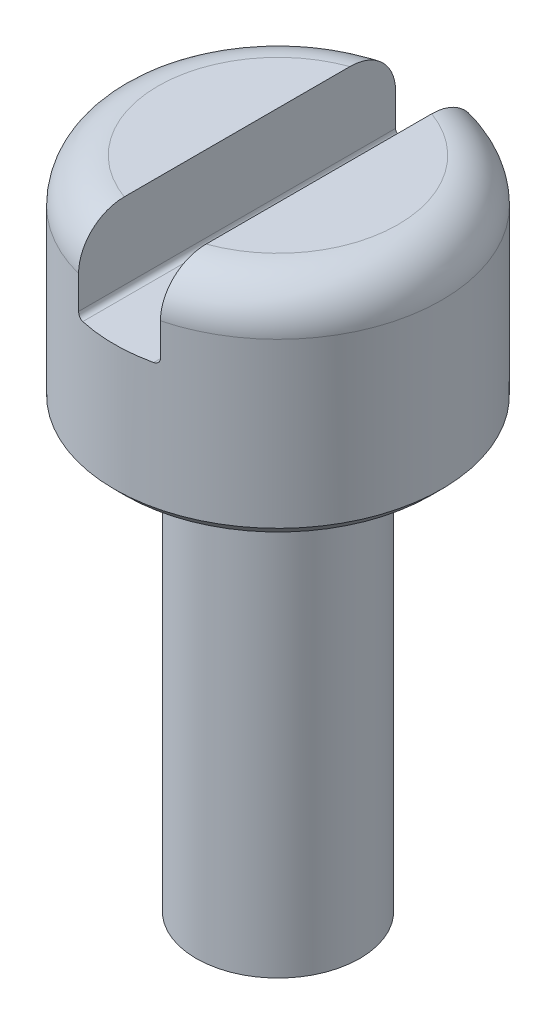
ISO-10303-21;
HEADER;
FILE_DESCRIPTION(('STEP AP214'),'2;1');
FILE_NAME('part.step','',(''),(''),'','','');
FILE_SCHEMA(('AUTOMOTIVE_DESIGN { 1 0 10303 214 1 1 1 1 }'));
ENDSEC;
DATA;
#1=APPLICATION_CONTEXT('core data for automotive mechanical design processes');
#2=APPLICATION_PROTOCOL_DEFINITION('international standard','automotive_design',2000,#1);
#3=PRODUCT_CONTEXT('',#1,'mechanical');
#4=PRODUCT('Part','Part','',(#3));
#5=PRODUCT_RELATED_PRODUCT_CATEGORY('part','',(#4));
#6=PRODUCT_DEFINITION_FORMATION('','',#4);
#7=PRODUCT_DEFINITION_CONTEXT('part definition',#1,'design');
#8=PRODUCT_DEFINITION('design','',#6,#7);
#9=PRODUCT_DEFINITION_SHAPE('','',#8);
#10=(LENGTH_UNIT() NAMED_UNIT(*) SI_UNIT(.MILLI.,.METRE.));
#11=(NAMED_UNIT(*) PLANE_ANGLE_UNIT() SI_UNIT($,.RADIAN.));
#12=(NAMED_UNIT(*) SI_UNIT($,.STERADIAN.) SOLID_ANGLE_UNIT());
#13=UNCERTAINTY_MEASURE_WITH_UNIT(LENGTH_MEASURE(1.E-05),#10,'distance_accuracy_value','');
#14=(GEOMETRIC_REPRESENTATION_CONTEXT(3) GLOBAL_UNCERTAINTY_ASSIGNED_CONTEXT((#13)) GLOBAL_UNIT_ASSIGNED_CONTEXT((#10,
#11,#12)) REPRESENTATION_CONTEXT('',''));
#15=CARTESIAN_POINT('',(0.,0.,0.));
#16=DIRECTION('',(0.,0.,1.));
#17=DIRECTION('',(1.,0.,0.));
#18=AXIS2_PLACEMENT_3D('',#15,#16,#17);
#19=CARTESIAN_POINT('',(0.,0.,0.));
#20=DIRECTION('',(0.,1.,0.));
#21=DIRECTION('',(0.,0.,1.));
#22=AXIS2_PLACEMENT_3D('',#19,#20,#21);
#23=PLANE('',#22);
#24=CARTESIAN_POINT('',(0.,0.,0.));
#25=DIRECTION('',(0.,1.,0.));
#26=DIRECTION('',(0.,0.,1.));
#27=AXIS2_PLACEMENT_3D('',#24,#25,#26);
#28=CIRCLE('',#27,1.4);
#29=CARTESIAN_POINT('',(0.,0.,1.4));
#30=VERTEX_POINT('',#29);
#31=EDGE_CURVE('E173',#30,#30,#28,.F.);
#32=ORIENTED_EDGE('',*,*,#31,.T.);
#33=EDGE_LOOP('',(#32));
#34=FACE_BOUND('',#33,.T.);
#35=CARTESIAN_POINT('',(0.,0.,0.));
#36=DIRECTION('',(0.,1.,0.));
#37=DIRECTION('',(0.,0.,1.));
#38=AXIS2_PLACEMENT_3D('',#35,#36,#37);
#39=CIRCLE('',#38,0.75);
#40=CARTESIAN_POINT('',(0.,0.,0.75));
#41=VERTEX_POINT('',#40);
#42=EDGE_CURVE('E125',#41,#41,#39,.F.);
#43=ORIENTED_EDGE('',*,*,#42,.F.);
#44=EDGE_LOOP('',(#43));
#45=FACE_BOUND('',#44,.T.);
#46=ADVANCED_FACE('F33',(#34,#45),#23,.F.);
#47=CARTESIAN_POINT('',(0.,2.,0.));
#48=DIRECTION('',(0.,1.,0.));
#49=DIRECTION('',(0.,0.,1.));
#50=AXIS2_PLACEMENT_3D('',#47,#48,#49);
#51=PLANE('',#50);
#52=DIRECTION('',(0.,0.,-1.));
#53=VECTOR('',#52,1.);
#54=CARTESIAN_POINT('',(0.375000000000001,2.,0.));
#55=LINE('',#54,#53);
#56=CARTESIAN_POINT('',(0.375000000000001,2.,1.03410589399732));
#57=VERTEX_POINT('',#56);
#58=CARTESIAN_POINT('',(0.375000000000001,2.,-1.03410589399732));
#59=VERTEX_POINT('',#58);
#60=EDGE_CURVE('E217',#57,#59,#55,.T.);
#61=ORIENTED_EDGE('',*,*,#60,.F.);
#62=CARTESIAN_POINT('',(0.,2.,0.));
#63=DIRECTION('',(0.,1.,0.));
#64=DIRECTION('',(0.,0.,1.));
#65=AXIS2_PLACEMENT_3D('',#62,#63,#64);
#66=CIRCLE('',#65,1.1);
#67=EDGE_CURVE('E176',#57,#59,#66,.T.);
#68=ORIENTED_EDGE('',*,*,#67,.T.);
#69=EDGE_LOOP('',(#61,#68));
#70=FACE_BOUND('',#69,.T.);
#71=ADVANCED_FACE('F204',(#70),#51,.T.);
#72=CARTESIAN_POINT('',(0.,2.,0.));
#73=DIRECTION('',(0.,-1.,0.));
#74=DIRECTION('',(0.,0.,-1.));
#75=AXIS2_PLACEMENT_3D('',#72,#73,#74);
#76=CYLINDRICAL_SURFACE('',#75,1.5);
#77=CARTESIAN_POINT('',(0.,0.0999999999999994,0.));
#78=DIRECTION('',(0.,1.,0.));
#79=DIRECTION('',(0.,0.,1.));
#80=AXIS2_PLACEMENT_3D('',#77,#78,#79);
#81=CIRCLE('',#80,1.5);
#82=CARTESIAN_POINT('',(0.,0.0999999999999994,1.5));
#83=VERTEX_POINT('',#82);
#84=EDGE_CURVE('E170',#83,#83,#81,.T.);
#85=ORIENTED_EDGE('',*,*,#84,.T.);
#86=EDGE_LOOP('',(#85));
#87=FACE_BOUND('',#86,.T.);
#88=DIRECTION('',(0.,-1.,0.));
#89=VECTOR('',#88,1.);
#90=CARTESIAN_POINT('',(0.375000000000001,2.,-1.45236875482778));
#91=LINE('',#90,#89);
#92=CARTESIAN_POINT('',(0.375000000000001,1.3,-1.45236875482778));
#93=VERTEX_POINT('',#92);
#94=CARTESIAN_POINT('',(0.375000000000001,1.6,-1.45236875482778));
#95=VERTEX_POINT('',#94);
#96=EDGE_CURVE('E224',#93,#95,#91,.F.);
#97=ORIENTED_EDGE('',*,*,#96,.T.);
#98=CARTESIAN_POINT('',(0.,1.6,0.));
#99=DIRECTION('',(0.,1.,0.));
#100=DIRECTION('',(0.,0.,1.));
#101=AXIS2_PLACEMENT_3D('',#98,#99,#100);
#102=CIRCLE('',#101,1.5);
#103=CARTESIAN_POINT('',(0.375000000000001,1.6,1.45236875482778));
#104=VERTEX_POINT('',#103);
#105=EDGE_CURVE('E283',#95,#104,#102,.F.);
#106=ORIENTED_EDGE('',*,*,#105,.T.);
#107=DIRECTION('',(0.,-1.,0.));
#108=VECTOR('',#107,1.);
#109=CARTESIAN_POINT('',(0.375000000000001,2.,1.45236875482778));
#110=LINE('',#109,#108);
#111=CARTESIAN_POINT('',(0.375000000000001,1.3,1.45236875482778));
#112=VERTEX_POINT('',#111);
#113=EDGE_CURVE('E222',#104,#112,#110,.T.);
#114=ORIENTED_EDGE('',*,*,#113,.T.);
#115=CARTESIAN_POINT('',(0.375000000000001,1.3,1.45236875482778));
#116=CARTESIAN_POINT('',(0.375002658495843,1.29724898962302,1.45236784547241));
#117=CARTESIAN_POINT('',(0.374773132764428,1.29449928598193,1.45242732919203));
#118=CARTESIAN_POINT('',(0.373870036300043,1.28908348301418,1.45266017482927));
#119=CARTESIAN_POINT('',(0.373197240015892,1.28641724635535,1.45283333813264));
#120=CARTESIAN_POINT('',(0.37142768061666,1.28123890723074,1.45328670886449));
#121=CARTESIAN_POINT('',(0.370330861346044,1.27872682523153,1.4535669304712));
#122=CARTESIAN_POINT('',(0.367749175369409,1.27392439303367,1.45422223994348));
#123=CARTESIAN_POINT('',(0.366264268601107,1.27163406576024,1.45459733760298));
#124=CARTESIAN_POINT('',(0.362926608333273,1.26730197875213,1.45543370437349));
#125=CARTESIAN_POINT('',(0.361068751668264,1.26526438415234,1.45589616301892));
#126=CARTESIAN_POINT('',(0.357053454126961,1.2615279312873,1.45688609755999));
#127=CARTESIAN_POINT('',(0.354895935139976,1.25982916162313,1.45741359040355));
#128=CARTESIAN_POINT('',(0.350273958150988,1.25676646552711,1.45853144095106));
#129=CARTESIAN_POINT('',(0.347802332912177,1.25541387141034,1.45912319237098));
#130=CARTESIAN_POINT('',(0.342673803954017,1.25314389356196,1.46033612476992));
#131=CARTESIAN_POINT('',(0.340016951014765,1.25222639108414,1.46095729766821));
#132=CARTESIAN_POINT('',(0.335294349979139,1.25102723759926,1.46204717854776));
#133=CARTESIAN_POINT('',(0.333253629914518,1.25064246855568,1.46251372764157));
#134=CARTESIAN_POINT('',(0.329142521258858,1.2501288288351,1.46344446391912));
#135=CARTESIAN_POINT('',(0.327072174187489,1.24999962977475,1.4639086533684));
#136=CARTESIAN_POINT('',(0.325000000000262,1.24999999999895,1.46436846456072));
#137=B_SPLINE_CURVE_WITH_KNOTS('',3,(#115,#116,#117,#118,#119,#120,#121,#122,#123,#124,#125,
#126,#127,#128,#129,#130,#131,#132,#133,#134,#135,#136),.UNSPECIFIED.,.F.,.F.,(4,2,2,2,2,2,2,2,
2,2,4),(0.,0.00824084837905611,0.0164673370150729,0.0246949155005202,0.0329233436548431,
0.0412731534711645,0.0496251438676928,0.0582230587972141,0.066818625811217,0.0731890380337759,
0.0795512595458543),.UNSPECIFIED.);
#138=CARTESIAN_POINT('',(0.325000000000001,1.25,1.46436846456075));
#139=VERTEX_POINT('',#138);
#140=EDGE_CURVE('E114',#112,#139,#137,.T.);
#141=ORIENTED_EDGE('',*,*,#140,.T.);
#142=CARTESIAN_POINT('',(0.,1.25,0.));
#143=DIRECTION('',(0.,-1.,0.));
#144=DIRECTION('',(0.,0.,-1.));
#145=AXIS2_PLACEMENT_3D('',#142,#143,#144);
#146=CIRCLE('',#145,1.5);
#147=CARTESIAN_POINT('',(-0.325,1.25,1.46436846456075));
#148=VERTEX_POINT('',#147);
#149=EDGE_CURVE('E126',#139,#148,#146,.T.);
#150=ORIENTED_EDGE('',*,*,#149,.T.);
#151=CARTESIAN_POINT('',(-0.325,1.25,1.46436846456075));
#152=CARTESIAN_POINT('',(-0.327876686191335,1.24999793567271,1.46373035847683));
#153=CARTESIAN_POINT('',(-0.330750733667663,1.25024813269043,1.46308327005522));
#154=CARTESIAN_POINT('',(-0.336413759925056,1.25123597933252,1.46179134924501));
#155=CARTESIAN_POINT('',(-0.33920275640253,1.25197352682073,1.46114651641215));
#156=CARTESIAN_POINT('',(-0.344618668530109,1.25391955932842,1.45987869041038));
#157=CARTESIAN_POINT('',(-0.347245493067138,1.2551283063424,1.45925570960196));
#158=CARTESIAN_POINT('',(-0.352258815800682,1.25798485111387,1.45805361954324));
#159=CARTESIAN_POINT('',(-0.354645384080543,1.25963252032232,1.4574744975115));
#160=CARTESIAN_POINT('',(-0.359088558777296,1.26330915714928,1.45638614756311));
#161=CARTESIAN_POINT('',(-0.361147712138581,1.26533488490247,1.4558763850956));
#162=CARTESIAN_POINT('',(-0.364894900320714,1.26972267066053,1.45494173441934));
#163=CARTESIAN_POINT('',(-0.366582895052759,1.27208476495096,1.4545168553793));
#164=CARTESIAN_POINT('',(-0.369492580489514,1.27701319429203,1.45378039478909));
#165=CARTESIAN_POINT('',(-0.370725114864685,1.27957274202579,1.45346618825205));
#166=CARTESIAN_POINT('',(-0.372740702329019,1.28487249665361,1.45295060547192));
#167=CARTESIAN_POINT('',(-0.37352422295132,1.28761251230872,1.45274911187234));
#168=CARTESIAN_POINT('',(-0.374378972449828,1.29198006815951,1.45252899501748));
#169=CARTESIAN_POINT('',(-0.374611720287969,1.29357565700116,1.45246896719965));
#170=CARTESIAN_POINT('',(-0.374922180924248,1.29678056195335,1.45238884879229));
#171=CARTESIAN_POINT('',(-0.375000111689678,1.29838985555626,1.45236870205424));
#172=CARTESIAN_POINT('',(-0.375000000000033,1.29999999999999,1.4523687548278));
#173=B_SPLINE_CURVE_WITH_KNOTS('',3,(#151,#152,#153,#154,#155,#156,#157,#158,#159,#160,#161,
#162,#163,#164,#165,#166,#167,#168,#169,#170,#171,#172),.UNSPECIFIED.,.F.,.F.,(4,2,2,2,2,2,2,2,
2,2,4),(0.,0.00882838583704185,0.0176549220575412,0.026486372990102,0.0353152402560846,
0.0440716582890352,0.0528290216376884,0.0613619075509072,0.0698858924236887,0.0747194623886041,
0.0795462223234138),.UNSPECIFIED.);
#174=CARTESIAN_POINT('',(-0.375,1.3,1.45236875482778));
#175=VERTEX_POINT('',#174);
#176=EDGE_CURVE('E115',#148,#175,#173,.T.);
#177=ORIENTED_EDGE('',*,*,#176,.T.);
#178=DIRECTION('',(0.,-1.,0.));
#179=VECTOR('',#178,1.);
#180=CARTESIAN_POINT('',(-0.375,2.,1.45236875482778));
#181=LINE('',#180,#179);
#182=CARTESIAN_POINT('',(-0.375,1.6,1.45236875482778));
#183=VERTEX_POINT('',#182);
#184=EDGE_CURVE('E227',#175,#183,#181,.F.);
#185=ORIENTED_EDGE('',*,*,#184,.T.);
#186=CARTESIAN_POINT('',(0.,1.6,0.));
#187=DIRECTION('',(0.,1.,0.));
#188=DIRECTION('',(0.,0.,1.));
#189=AXIS2_PLACEMENT_3D('',#186,#187,#188);
#190=CIRCLE('',#189,1.5);
#191=CARTESIAN_POINT('',(-0.375,1.6,-1.45236875482778));
#192=VERTEX_POINT('',#191);
#193=EDGE_CURVE('E281',#183,#192,#190,.F.);
#194=ORIENTED_EDGE('',*,*,#193,.T.);
#195=DIRECTION('',(0.,-1.,0.));
#196=VECTOR('',#195,1.);
#197=CARTESIAN_POINT('',(-0.375,2.,-1.45236875482778));
#198=LINE('',#197,#196);
#199=CARTESIAN_POINT('',(-0.375,1.3,-1.45236875482778));
#200=VERTEX_POINT('',#199);
#201=EDGE_CURVE('E109',#192,#200,#198,.T.);
#202=ORIENTED_EDGE('',*,*,#201,.T.);
#203=CARTESIAN_POINT('',(-0.375,1.3,-1.45236875482778));
#204=CARTESIAN_POINT('',(-0.375002658495842,1.29724898962302,-1.45236784547241));
#205=CARTESIAN_POINT('',(-0.374773132764427,1.29449928598193,-1.45242732919203));
#206=CARTESIAN_POINT('',(-0.373870036300042,1.28908348301418,-1.45266017482927));
#207=CARTESIAN_POINT('',(-0.373197240015892,1.28641724635535,-1.45283333813264));
#208=CARTESIAN_POINT('',(-0.37142768061666,1.28123890723074,-1.45328670886449));
#209=CARTESIAN_POINT('',(-0.370330861346043,1.27872682523153,-1.4535669304712));
#210=CARTESIAN_POINT('',(-0.367749175369408,1.27392439303367,-1.45422223994348));
#211=CARTESIAN_POINT('',(-0.366264268601106,1.27163406576024,-1.45459733760298));
#212=CARTESIAN_POINT('',(-0.362926608333272,1.26730197875213,-1.45543370437349));
#213=CARTESIAN_POINT('',(-0.361068751668263,1.26526438415234,-1.45589616301892));
#214=CARTESIAN_POINT('',(-0.35705345412696,1.2615279312873,-1.45688609755999));
#215=CARTESIAN_POINT('',(-0.354895935139975,1.25982916162313,-1.45741359040355));
#216=CARTESIAN_POINT('',(-0.350273958150987,1.25676646552711,-1.45853144095106));
#217=CARTESIAN_POINT('',(-0.347802332912176,1.25541387141034,-1.45912319237098));
#218=CARTESIAN_POINT('',(-0.342673803954017,1.25314389356196,-1.46033612476992));
#219=CARTESIAN_POINT('',(-0.340016951014764,1.25222639108414,-1.46095729766821));
#220=CARTESIAN_POINT('',(-0.335294349979138,1.25102723759926,-1.46204717854776));
#221=CARTESIAN_POINT('',(-0.333253629914518,1.25064246855568,-1.46251372764157));
#222=CARTESIAN_POINT('',(-0.329142521258857,1.2501288288351,-1.46344446391912));
#223=CARTESIAN_POINT('',(-0.327072174187488,1.24999962977475,-1.4639086533684));
#224=CARTESIAN_POINT('',(-0.325000000000261,1.24999999999895,-1.46436846456072));
#225=B_SPLINE_CURVE_WITH_KNOTS('',3,(#203,#204,#205,#206,#207,#208,#209,#210,#211,#212,#213,
#214,#215,#216,#217,#218,#219,#220,#221,#222,#223,#224),.UNSPECIFIED.,.F.,.F.,(4,2,2,2,2,2,2,2,
2,2,4),(0.,0.00824084837905612,0.0164673370150729,0.0246949155005202,0.0329233436548431,
0.0412731534711645,0.0496251438676928,0.0582230587972142,0.0668186258112169,0.0731890380337758,
0.0795512595458542),.UNSPECIFIED.);
#226=CARTESIAN_POINT('',(-0.325,1.25,-1.46436846456075));
#227=VERTEX_POINT('',#226);
#228=EDGE_CURVE('E103',#200,#227,#225,.T.);
#229=ORIENTED_EDGE('',*,*,#228,.T.);
#230=CARTESIAN_POINT('',(0.325000000000001,1.25,-1.46436846456075));
#231=VERTEX_POINT('',#230);
#232=EDGE_CURVE('E107',#227,#231,#146,.T.);
#233=ORIENTED_EDGE('',*,*,#232,.T.);
#234=CARTESIAN_POINT('',(0.325000000000001,1.25,-1.46436846456075));
#235=CARTESIAN_POINT('',(0.327876686191335,1.24999793567271,-1.46373035847683));
#236=CARTESIAN_POINT('',(0.330750733667664,1.25024813269043,-1.46308327005522));
#237=CARTESIAN_POINT('',(0.336413759925056,1.25123597933252,-1.46179134924501));
#238=CARTESIAN_POINT('',(0.339202756402531,1.25197352682073,-1.46114651641215));
#239=CARTESIAN_POINT('',(0.34461866853011,1.25391955932842,-1.45987869041038));
#240=CARTESIAN_POINT('',(0.347245493067138,1.2551283063424,-1.45925570960196));
#241=CARTESIAN_POINT('',(0.352258815800682,1.25798485111387,-1.45805361954323));
#242=CARTESIAN_POINT('',(0.354645384080544,1.25963252032232,-1.4574744975115));
#243=CARTESIAN_POINT('',(0.359088558777297,1.26330915714928,-1.45638614756311));
#244=CARTESIAN_POINT('',(0.361147712138582,1.26533488490247,-1.4558763850956));
#245=CARTESIAN_POINT('',(0.364894900320715,1.26972267066053,-1.45494173441934));
#246=CARTESIAN_POINT('',(0.36658289505276,1.27208476495096,-1.4545168553793));
#247=CARTESIAN_POINT('',(0.369492580489515,1.27701319429203,-1.45378039478909));
#248=CARTESIAN_POINT('',(0.370725114864686,1.27957274202579,-1.45346618825205));
#249=CARTESIAN_POINT('',(0.37274070232902,1.28487249665361,-1.45295060547192));
#250=CARTESIAN_POINT('',(0.37352422295132,1.28761251230872,-1.45274911187234));
#251=CARTESIAN_POINT('',(0.374378972449829,1.29198006815951,-1.45252899501748));
#252=CARTESIAN_POINT('',(0.374611720287969,1.29357565700116,-1.45246896719965));
#253=CARTESIAN_POINT('',(0.374922180924249,1.29678056195335,-1.45238884879229));
#254=CARTESIAN_POINT('',(0.375000111689678,1.29838985555626,-1.45236870205424));
#255=CARTESIAN_POINT('',(0.375000000000033,1.3,-1.4523687548278));
#256=B_SPLINE_CURVE_WITH_KNOTS('',3,(#234,#235,#236,#237,#238,#239,#240,#241,#242,#243,#244,
#245,#246,#247,#248,#249,#250,#251,#252,#253,#254,#255),.UNSPECIFIED.,.F.,.F.,(4,2,2,2,2,2,2,2,
2,2,4),(0.,0.0088283858370419,0.0176549220575413,0.0264863729901023,0.0353152402560849,
0.0440716582890355,0.0528290216376885,0.0613619075509074,0.0698858924236887,0.0747194623886043,
0.079546222323414),.UNSPECIFIED.);
#257=EDGE_CURVE('E165',#231,#93,#256,.T.);
#258=ORIENTED_EDGE('',*,*,#257,.T.);
#259=EDGE_LOOP('',(#97,#106,#114,#141,#150,#177,#185,#194,#202,#229,#233,#258));
#260=FACE_BOUND('',#259,.T.);
#261=ADVANCED_FACE('F106',(#87,#260),#76,.T.);
#262=DIRECTION('',(0.,0.,1.));
#263=VECTOR('',#262,1.);
#264=CARTESIAN_POINT('',(-0.375,2.,0.));
#265=LINE('',#264,#263);
#266=CARTESIAN_POINT('',(-0.375,2.,-1.03410589399732));
#267=VERTEX_POINT('',#266);
#268=CARTESIAN_POINT('',(-0.375,2.,1.03410589399732));
#269=VERTEX_POINT('',#268);
#270=EDGE_CURVE('E220',#267,#269,#265,.T.);
#271=ORIENTED_EDGE('',*,*,#270,.F.);
#272=CARTESIAN_POINT('',(0.,2.,0.));
#273=DIRECTION('',(0.,1.,0.));
#274=DIRECTION('',(0.,0.,1.));
#275=AXIS2_PLACEMENT_3D('',#272,#273,#274);
#276=CIRCLE('',#275,1.1);
#277=EDGE_CURVE('E282',#267,#269,#276,.T.);
#278=ORIENTED_EDGE('',*,*,#277,.T.);
#279=EDGE_LOOP('',(#271,#278));
#280=FACE_BOUND('',#279,.T.);
#281=ADVANCED_FACE('F200',(#280),#51,.T.);
#282=CARTESIAN_POINT('',(-0.375,1.25,-6.));
#283=DIRECTION('',(0.,-1.,0.));
#284=DIRECTION('',(0.,0.,-1.));
#285=AXIS2_PLACEMENT_3D('',#282,#283,#284);
#286=PLANE('',#285);
#287=ORIENTED_EDGE('',*,*,#232,.F.);
#288=DIRECTION('',(0.,0.,1.));
#289=VECTOR('',#288,1.);
#290=CARTESIAN_POINT('',(-0.325,1.25,1.45236875482778));
#291=LINE('',#290,#289);
#292=EDGE_CURVE('E121',#227,#148,#291,.T.);
#293=ORIENTED_EDGE('',*,*,#292,.T.);
#294=ORIENTED_EDGE('',*,*,#149,.F.);
#295=DIRECTION('',(0.,0.,1.));
#296=VECTOR('',#295,1.);
#297=CARTESIAN_POINT('',(0.325000000000001,1.25,-1.45236875482778));
#298=LINE('',#297,#296);
#299=EDGE_CURVE('E124',#139,#231,#298,.F.);
#300=ORIENTED_EDGE('',*,*,#299,.T.);
#301=EDGE_LOOP('',(#287,#293,#294,#300));
#302=FACE_BOUND('',#301,.T.);
#303=ADVANCED_FACE('F119',(#302),#286,.F.);
#304=CARTESIAN_POINT('',(0.375,2.75,-6.));
#305=DIRECTION('',(1.,0.,0.));
#306=DIRECTION('',(0.,1.,0.));
#307=AXIS2_PLACEMENT_3D('',#304,#305,#306);
#308=PLANE('',#307);
#309=ORIENTED_EDGE('',*,*,#60,.T.);
#310=CARTESIAN_POINT('',(0.375000000000001,2.,-1.03410589399732));
#311=CARTESIAN_POINT('',(0.375000000000001,2.00002054404724,-1.05859414483725));
#312=CARTESIAN_POINT('',(0.375000000000001,1.99801309002006,-1.08309677144136));
#313=CARTESIAN_POINT('',(0.375000000000001,1.98997412107739,-1.13146602348752));
#314=CARTESIAN_POINT('',(0.375000000000001,1.9839369552283,-1.15533170678782));
#315=CARTESIAN_POINT('',(0.375000000000001,1.96785621282729,-1.20173120017045));
#316=CARTESIAN_POINT('',(0.375000000000001,1.95780545859163,-1.22426254064219));
#317=CARTESIAN_POINT('',(0.375000000000001,1.93391555527867,-1.26719756321387));
#318=CARTESIAN_POINT('',(0.375000000000001,1.92008008852283,-1.28760328691476));
#319=CARTESIAN_POINT('',(0.375000000000001,1.88960055355637,-1.32483769592998));
#320=CARTESIAN_POINT('',(0.375000000000001,1.87309216667696,-1.34177740729757));
#321=CARTESIAN_POINT('',(0.375000000000001,1.83734991552529,-1.37250398084195));
#322=CARTESIAN_POINT('',(0.375000000000001,1.81811555703678,-1.38629027011876));
#323=CARTESIAN_POINT('',(0.375000000000001,1.77834082268141,-1.40972197171244));
#324=CARTESIAN_POINT('',(0.375000000000001,1.75788701854586,-1.41951470587319));
#325=CARTESIAN_POINT('',(0.375000000000001,1.71560526324058,-1.43541406235943));
#326=CARTESIAN_POINT('',(0.375000000000001,1.69377890103785,-1.44152486344322));
#327=CARTESIAN_POINT('',(0.375000000000001,1.65979909622031,-1.44791468223779));
#328=CARTESIAN_POINT('',(0.375000000000001,1.6478913520382,-1.44958447704272));
#329=CARTESIAN_POINT('',(0.375000000000001,1.6239910336963,-1.45181081933061));
#330=CARTESIAN_POINT('',(0.375000000000001,1.61199862117774,-1.45236910239242));
#331=CARTESIAN_POINT('',(0.375000000000001,1.6000000000001,-1.45236875482831));
#332=B_SPLINE_CURVE_WITH_KNOTS('',3,(#310,#311,#312,#313,#314,#315,#316,#317,#318,#319,#320,
#321,#322,#323,#324,#325,#326,#327,#328,#329,#330,#331),.UNSPECIFIED.,.F.,.F.,(4,2,2,2,2,2,2,2,
2,2,4),(0.,0.0734044431986391,0.146912039566271,0.220551685899054,0.294119938098343,
0.364722927579814,0.435338733734736,0.50304236899662,0.570669019517503,0.606695964947917,
0.642666611559729),.UNSPECIFIED.);
#333=EDGE_CURVE('E185',#59,#95,#332,.T.);
#334=ORIENTED_EDGE('',*,*,#333,.T.);
#335=ORIENTED_EDGE('',*,*,#96,.F.);
#336=DIRECTION('',(0.,0.,1.));
#337=VECTOR('',#336,1.);
#338=CARTESIAN_POINT('',(0.375000000000001,1.3,1.45236875482778));
#339=LINE('',#338,#337);
#340=EDGE_CURVE('E131',#93,#112,#339,.T.);
#341=ORIENTED_EDGE('',*,*,#340,.T.);
#342=ORIENTED_EDGE('',*,*,#113,.F.);
#343=CARTESIAN_POINT('',(0.375000000000001,1.6,1.45236875482778));
#344=CARTESIAN_POINT('',(0.375000000000001,1.62194311944841,1.45239000694275));
#345=CARTESIAN_POINT('',(0.375000000000001,1.64387742008292,1.45050530654636));
#346=CARTESIAN_POINT('',(0.375000000000001,1.68708626921121,1.44308444810129));
#347=CARTESIAN_POINT('',(0.375000000000001,1.70836177365356,1.43755386807543));
#348=CARTESIAN_POINT('',(0.375000000000001,1.74968666753501,1.4229990315784));
#349=CARTESIAN_POINT('',(0.375000000000001,1.76973575600846,1.41397392149181));
#350=CARTESIAN_POINT('',(0.375000000000001,1.80805635240306,1.39272294688028));
#351=CARTESIAN_POINT('',(0.375000000000001,1.82632780189734,1.38049697719922));
#352=CARTESIAN_POINT('',(0.375000000000001,1.86080909428912,1.3530666772213));
#353=CARTESIAN_POINT('',(0.375000000000001,1.8769938586527,1.33783085551667));
#354=CARTESIAN_POINT('',(0.375000000000001,1.9066654071153,1.30492833951887));
#355=CARTESIAN_POINT('',(0.375000000000001,1.92015185402367,1.28726134188291));
#356=CARTESIAN_POINT('',(0.375000000000001,1.94449002754198,1.2494435109666));
#357=CARTESIAN_POINT('',(0.375000000000001,1.95525043624028,1.22923400569205));
#358=CARTESIAN_POINT('',(0.375000000000001,1.97338564710884,1.1873445597769));
#359=CARTESIAN_POINT('',(0.375000000000001,1.9807595758621,1.16566424144749));
#360=CARTESIAN_POINT('',(0.375000000000001,1.9909364958866,1.12566961473705));
#361=CARTESIAN_POINT('',(0.375000000000001,1.99434437470506,1.10750570117451));
#362=CARTESIAN_POINT('',(0.375000000000001,1.99887639920065,1.07092932908205));
#363=CARTESIAN_POINT('',(0.375000000000001,2.00000485767181,1.0525174064026));
#364=CARTESIAN_POINT('',(0.375000000000001,2.,1.03410589399732));
#365=B_SPLINE_CURVE_WITH_KNOTS('',3,(#343,#344,#345,#346,#347,#348,#349,#350,#351,#352,#353,
#354,#355,#356,#357,#358,#359,#360,#361,#362,#363,#364),.UNSPECIFIED.,.F.,.F.,(4,2,2,2,2,2,2,2,
2,2,4),(0.,0.0657353255373086,0.131370311834199,0.197021341037152,0.262674527308378,
0.329054959569417,0.395443681774566,0.463826735120332,0.532227415449125,0.587530478401945,
0.642728806405055),.UNSPECIFIED.);
#366=EDGE_CURVE('E179',#104,#57,#365,.T.);
#367=ORIENTED_EDGE('',*,*,#366,.T.);
#368=EDGE_LOOP('',(#309,#334,#335,#341,#342,#367));
#369=FACE_BOUND('',#368,.T.);
#370=ADVANCED_FACE('F192',(#369),#308,.F.);
#371=CARTESIAN_POINT('',(-0.375,2.75,-6.));
#372=DIRECTION('',(-1.,0.,0.));
#373=DIRECTION('',(0.,-1.,0.));
#374=AXIS2_PLACEMENT_3D('',#371,#372,#373);
#375=PLANE('',#374);
#376=ORIENTED_EDGE('',*,*,#270,.T.);
#377=CARTESIAN_POINT('',(-0.375,2.,1.03410589399732));
#378=CARTESIAN_POINT('',(-0.375,2.00002054404724,1.05859414483725));
#379=CARTESIAN_POINT('',(-0.375,1.99801309002006,1.08309677144136));
#380=CARTESIAN_POINT('',(-0.375,1.98997412107739,1.13146602348753));
#381=CARTESIAN_POINT('',(-0.375,1.9839369552283,1.15533170678782));
#382=CARTESIAN_POINT('',(-0.375,1.96785621282729,1.20173120017045));
#383=CARTESIAN_POINT('',(-0.375,1.95780545859163,1.22426254064219));
#384=CARTESIAN_POINT('',(-0.375,1.93391555527867,1.26719756321387));
#385=CARTESIAN_POINT('',(-0.375,1.92008008852283,1.28760328691476));
#386=CARTESIAN_POINT('',(-0.375,1.88960055355637,1.32483769592998));
#387=CARTESIAN_POINT('',(-0.375,1.87309216667696,1.34177740729757));
#388=CARTESIAN_POINT('',(-0.375,1.83734991552529,1.37250398084195));
#389=CARTESIAN_POINT('',(-0.375,1.81811555703678,1.38629027011876));
#390=CARTESIAN_POINT('',(-0.375,1.77834082268141,1.40972197171244));
#391=CARTESIAN_POINT('',(-0.375,1.75788701854586,1.41951470587319));
#392=CARTESIAN_POINT('',(-0.375,1.71560526324058,1.43541406235943));
#393=CARTESIAN_POINT('',(-0.375,1.69377890103785,1.44152486344322));
#394=CARTESIAN_POINT('',(-0.375,1.65979909622031,1.44791468223779));
#395=CARTESIAN_POINT('',(-0.375,1.6478913520382,1.44958447704272));
#396=CARTESIAN_POINT('',(-0.375,1.6239910336963,1.45181081933061));
#397=CARTESIAN_POINT('',(-0.375,1.61199862117774,1.45236910239242));
#398=CARTESIAN_POINT('',(-0.375,1.6000000000001,1.45236875482831));
#399=B_SPLINE_CURVE_WITH_KNOTS('',3,(#377,#378,#379,#380,#381,#382,#383,#384,#385,#386,#387,
#388,#389,#390,#391,#392,#393,#394,#395,#396,#397,#398),.UNSPECIFIED.,.F.,.F.,(4,2,2,2,2,2,2,2,
2,2,4),(0.,0.0734044431986391,0.146912039566271,0.220551685899054,0.294119938098342,
0.364722927579814,0.435338733734736,0.50304236899662,0.570669019517503,0.606695964947916,
0.642666611559729),.UNSPECIFIED.);
#400=EDGE_CURVE('E11',#269,#183,#399,.T.);
#401=ORIENTED_EDGE('',*,*,#400,.T.);
#402=ORIENTED_EDGE('',*,*,#184,.F.);
#403=DIRECTION('',(0.,0.,1.));
#404=VECTOR('',#403,1.);
#405=CARTESIAN_POINT('',(-0.375,1.3,-1.45236875482778));
#406=LINE('',#405,#404);
#407=EDGE_CURVE('E129',#175,#200,#406,.F.);
#408=ORIENTED_EDGE('',*,*,#407,.T.);
#409=ORIENTED_EDGE('',*,*,#201,.F.);
#410=CARTESIAN_POINT('',(-0.375,1.6,-1.45236875482778));
#411=CARTESIAN_POINT('',(-0.375,1.62194311944841,-1.45239000694275));
#412=CARTESIAN_POINT('',(-0.375,1.64387742008292,-1.45050530654636));
#413=CARTESIAN_POINT('',(-0.375,1.68708626921121,-1.44308444810129));
#414=CARTESIAN_POINT('',(-0.375,1.70836177365356,-1.43755386807543));
#415=CARTESIAN_POINT('',(-0.375,1.74968666753501,-1.4229990315784));
#416=CARTESIAN_POINT('',(-0.375,1.76973575600846,-1.41397392149181));
#417=CARTESIAN_POINT('',(-0.375,1.80805635240306,-1.39272294688028));
#418=CARTESIAN_POINT('',(-0.375,1.82632780189734,-1.38049697719922));
#419=CARTESIAN_POINT('',(-0.375,1.86080909428912,-1.3530666772213));
#420=CARTESIAN_POINT('',(-0.375,1.8769938586527,-1.33783085551667));
#421=CARTESIAN_POINT('',(-0.375,1.9066654071153,-1.30492833951887));
#422=CARTESIAN_POINT('',(-0.375,1.92015185402367,-1.28726134188291));
#423=CARTESIAN_POINT('',(-0.375,1.94449002754198,-1.2494435109666));
#424=CARTESIAN_POINT('',(-0.375,1.95525043624028,-1.22923400569206));
#425=CARTESIAN_POINT('',(-0.375,1.97338564710884,-1.18734455977691));
#426=CARTESIAN_POINT('',(-0.375,1.9807595758621,-1.16566424144749));
#427=CARTESIAN_POINT('',(-0.375,1.9909364958866,-1.12566961473705));
#428=CARTESIAN_POINT('',(-0.375,1.99434437470506,-1.10750570117451));
#429=CARTESIAN_POINT('',(-0.375,1.99887639920065,-1.07092932908205));
#430=CARTESIAN_POINT('',(-0.375,2.00000485767181,-1.0525174064026));
#431=CARTESIAN_POINT('',(-0.375,2.,-1.03410589399732));
#432=B_SPLINE_CURVE_WITH_KNOTS('',3,(#410,#411,#412,#413,#414,#415,#416,#417,#418,#419,#420,
#421,#422,#423,#424,#425,#426,#427,#428,#429,#430,#431),.UNSPECIFIED.,.F.,.F.,(4,2,2,2,2,2,2,2,
2,2,4),(0.,0.0657353255373086,0.131370311834199,0.197021341037152,0.262674527308378,
0.329054959569417,0.395443681774566,0.463826735120332,0.532227415449125,0.587530478401944,
0.642728806405055),.UNSPECIFIED.);
#433=EDGE_CURVE('E46',#192,#267,#432,.T.);
#434=ORIENTED_EDGE('',*,*,#433,.T.);
#435=EDGE_LOOP('',(#376,#401,#402,#408,#409,#434));
#436=FACE_BOUND('',#435,.T.);
#437=ADVANCED_FACE('F196',(#436),#375,.F.);
#438=CARTESIAN_POINT('',(0.,-4.,0.));
#439=DIRECTION('',(0.,1.,0.));
#440=DIRECTION('',(0.,0.,1.));
#441=AXIS2_PLACEMENT_3D('',#438,#439,#440);
#442=CYLINDRICAL_SURFACE('',#441,0.75);
#443=CARTESIAN_POINT('',(0.,-4.,0.));
#444=DIRECTION('',(0.,-1.,0.));
#445=DIRECTION('',(0.,0.,-1.));
#446=AXIS2_PLACEMENT_3D('',#443,#444,#445);
#447=CIRCLE('',#446,0.75);
#448=CARTESIAN_POINT('',(0.,-4.,-0.75));
#449=VERTEX_POINT('',#448);
#450=EDGE_CURVE('E230',#449,#449,#447,.T.);
#451=ORIENTED_EDGE('',*,*,#450,.F.);
#452=EDGE_LOOP('',(#451));
#453=FACE_BOUND('',#452,.T.);
#454=ORIENTED_EDGE('',*,*,#42,.T.);
#455=EDGE_LOOP('',(#454));
#456=FACE_BOUND('',#455,.T.);
#457=ADVANCED_FACE('F235',(#453,#456),#442,.T.);
#458=CARTESIAN_POINT('',(0.,-4.,0.));
#459=DIRECTION('',(0.,-1.,0.));
#460=DIRECTION('',(0.,0.,-1.));
#461=AXIS2_PLACEMENT_3D('',#458,#459,#460);
#462=PLANE('',#461);
#463=ORIENTED_EDGE('',*,*,#450,.T.);
#464=EDGE_LOOP('',(#463));
#465=FACE_BOUND('',#464,.T.);
#466=ADVANCED_FACE('F153',(#465),#462,.T.);
#467=CARTESIAN_POINT('',(-0.325,1.3,-6.));
#468=DIRECTION('',(0.,0.,-1.));
#469=DIRECTION('',(-1.,0.,0.));
#470=AXIS2_PLACEMENT_3D('',#467,#468,#469);
#471=CYLINDRICAL_SURFACE('',#470,0.05);
#472=ORIENTED_EDGE('',*,*,#228,.F.);
#473=ORIENTED_EDGE('',*,*,#407,.F.);
#474=ORIENTED_EDGE('',*,*,#176,.F.);
#475=ORIENTED_EDGE('',*,*,#292,.F.);
#476=EDGE_LOOP('',(#472,#473,#474,#475));
#477=FACE_BOUND('',#476,.T.);
#478=ADVANCED_FACE('F128',(#477),#471,.F.);
#479=CARTESIAN_POINT('',(0.325000000000001,1.3,-6.));
#480=DIRECTION('',(0.,0.,-1.));
#481=DIRECTION('',(-1.,0.,0.));
#482=AXIS2_PLACEMENT_3D('',#479,#480,#481);
#483=CYLINDRICAL_SURFACE('',#482,0.05);
#484=ORIENTED_EDGE('',*,*,#257,.F.);
#485=ORIENTED_EDGE('',*,*,#299,.F.);
#486=ORIENTED_EDGE('',*,*,#140,.F.);
#487=ORIENTED_EDGE('',*,*,#340,.F.);
#488=EDGE_LOOP('',(#484,#485,#486,#487));
#489=FACE_BOUND('',#488,.T.);
#490=ADVANCED_FACE('F152',(#489),#483,.F.);
#491=CARTESIAN_POINT('',(0.,0.0999999999999994,0.));
#492=DIRECTION('',(0.,1.,0.));
#493=DIRECTION('',(0.,0.,1.));
#494=AXIS2_PLACEMENT_3D('',#491,#492,#493);
#495=CONICAL_SURFACE('',#494,1.5,0.785398163397448);
#496=ORIENTED_EDGE('',*,*,#31,.F.);
#497=EDGE_LOOP('',(#496));
#498=FACE_BOUND('',#497,.T.);
#499=ORIENTED_EDGE('',*,*,#84,.F.);
#500=EDGE_LOOP('',(#499));
#501=FACE_BOUND('',#500,.T.);
#502=ADVANCED_FACE('F158',(#498,#501),#495,.T.);
#503=CARTESIAN_POINT('',(0.,1.6,0.));
#504=DIRECTION('',(0.,1.,0.));
#505=DIRECTION('',(0.,0.,1.));
#506=AXIS2_PLACEMENT_3D('',#503,#504,#505);
#507=TOROIDAL_SURFACE('',#506,1.1,0.4);
#508=ORIENTED_EDGE('',*,*,#366,.F.);
#509=ORIENTED_EDGE('',*,*,#105,.F.);
#510=ORIENTED_EDGE('',*,*,#333,.F.);
#511=ORIENTED_EDGE('',*,*,#67,.F.);
#512=EDGE_LOOP('',(#508,#509,#510,#511));
#513=FACE_BOUND('',#512,.T.);
#514=ADVANCED_FACE('F190',(#513),#507,.T.);
#515=CARTESIAN_POINT('',(0.,1.6,0.));
#516=DIRECTION('',(0.,1.,0.));
#517=DIRECTION('',(0.,0.,1.));
#518=AXIS2_PLACEMENT_3D('',#515,#516,#517);
#519=TOROIDAL_SURFACE('',#518,1.1,0.4);
#520=ORIENTED_EDGE('',*,*,#433,.F.);
#521=ORIENTED_EDGE('',*,*,#193,.F.);
#522=ORIENTED_EDGE('',*,*,#400,.F.);
#523=ORIENTED_EDGE('',*,*,#277,.F.);
#524=EDGE_LOOP('',(#520,#521,#522,#523));
#525=FACE_BOUND('',#524,.T.);
#526=ADVANCED_FACE('F35',(#525),#519,.T.);
#527=CLOSED_SHELL('',(#46,#71,#261,#281,#303,#370,#437,#457,#466,#478,#490,#502,#514,#526));
#528=MANIFOLD_SOLID_BREP('B2',#527);
#529=ADVANCED_BREP_SHAPE_REPRESENTATION('',(#18,#528),#14);
#530=SHAPE_DEFINITION_REPRESENTATION(#9,#529);
ENDSEC;
END-ISO-10303-21;
